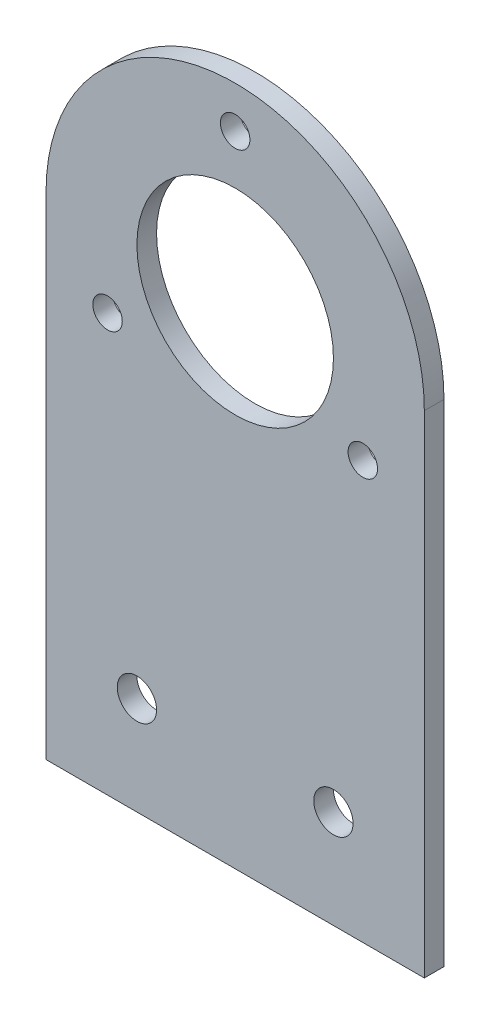
ISO-10303-21;
HEADER;
FILE_DESCRIPTION(('STEP AP214'),'2;1');
FILE_NAME('part.step','',(''),(''),'','','');
FILE_SCHEMA(('AUTOMOTIVE_DESIGN { 1 0 10303 214 1 1 1 1 }'));
ENDSEC;
DATA;
#1=APPLICATION_CONTEXT('core data for automotive mechanical design processes');
#2=APPLICATION_PROTOCOL_DEFINITION('international standard','automotive_design',2000,#1);
#3=PRODUCT_CONTEXT('',#1,'mechanical');
#4=PRODUCT('Part','Part','',(#3));
#5=PRODUCT_RELATED_PRODUCT_CATEGORY('part','',(#4));
#6=PRODUCT_DEFINITION_FORMATION('','',#4);
#7=PRODUCT_DEFINITION_CONTEXT('part definition',#1,'design');
#8=PRODUCT_DEFINITION('design','',#6,#7);
#9=PRODUCT_DEFINITION_SHAPE('','',#8);
#10=(LENGTH_UNIT() NAMED_UNIT(*) SI_UNIT(.MILLI.,.METRE.));
#11=(NAMED_UNIT(*) PLANE_ANGLE_UNIT() SI_UNIT($,.RADIAN.));
#12=(NAMED_UNIT(*) SI_UNIT($,.STERADIAN.) SOLID_ANGLE_UNIT());
#13=UNCERTAINTY_MEASURE_WITH_UNIT(LENGTH_MEASURE(1.E-05),#10,'distance_accuracy_value','');
#14=(GEOMETRIC_REPRESENTATION_CONTEXT(3) GLOBAL_UNCERTAINTY_ASSIGNED_CONTEXT((#13)) GLOBAL_UNIT_ASSIGNED_CONTEXT((#10,
#11,#12)) REPRESENTATION_CONTEXT('',''));
#15=CARTESIAN_POINT('',(0.,0.,0.));
#16=DIRECTION('',(0.,0.,1.));
#17=DIRECTION('',(1.,0.,0.));
#18=AXIS2_PLACEMENT_3D('',#15,#16,#17);
#19=CARTESIAN_POINT('',(0.,25.,2.));
#20=DIRECTION('',(0.,0.,-1.));
#21=DIRECTION('',(-1.,0.,0.));
#22=AXIS2_PLACEMENT_3D('',#19,#20,#21);
#23=CYLINDRICAL_SURFACE('',#22,19.25);
#24=CARTESIAN_POINT('',(0.,25.,0.));
#25=DIRECTION('',(0.,0.,1.));
#26=DIRECTION('',(1.,0.,0.));
#27=AXIS2_PLACEMENT_3D('',#24,#25,#26);
#28=CIRCLE('',#27,19.25);
#29=CARTESIAN_POINT('',(-19.25,25.,0.));
#30=VERTEX_POINT('',#29);
#31=CARTESIAN_POINT('',(19.25,25.,0.));
#32=VERTEX_POINT('',#31);
#33=EDGE_CURVE('E106',#30,#32,#28,.F.);
#34=ORIENTED_EDGE('',*,*,#33,.F.);
#35=DIRECTION('',(0.,0.,-1.));
#36=VECTOR('',#35,1.);
#37=CARTESIAN_POINT('',(-19.25,25.,2.));
#38=LINE('',#37,#36);
#39=CARTESIAN_POINT('',(-19.25,25.,2.));
#40=VERTEX_POINT('',#39);
#41=EDGE_CURVE('E11',#40,#30,#38,.T.);
#42=ORIENTED_EDGE('',*,*,#41,.F.);
#43=CARTESIAN_POINT('',(0.,25.,2.));
#44=DIRECTION('',(0.,0.,1.));
#45=DIRECTION('',(1.,0.,0.));
#46=AXIS2_PLACEMENT_3D('',#43,#44,#45);
#47=CIRCLE('',#46,19.25);
#48=CARTESIAN_POINT('',(19.25,25.,2.));
#49=VERTEX_POINT('',#48);
#50=EDGE_CURVE('E90',#40,#49,#47,.F.);
#51=ORIENTED_EDGE('',*,*,#50,.T.);
#52=DIRECTION('',(0.,0.,-1.));
#53=VECTOR('',#52,1.);
#54=CARTESIAN_POINT('',(19.25,25.,2.));
#55=LINE('',#54,#53);
#56=EDGE_CURVE('E52',#49,#32,#55,.T.);
#57=ORIENTED_EDGE('',*,*,#56,.T.);
#58=EDGE_LOOP('',(#34,#42,#51,#57));
#59=FACE_BOUND('',#58,.T.);
#60=ADVANCED_FACE('F35',(#59),#23,.T.);
#61=CARTESIAN_POINT('',(-19.25,0.,2.));
#62=DIRECTION('',(1.,0.,0.));
#63=DIRECTION('',(0.,1.,0.));
#64=AXIS2_PLACEMENT_3D('',#61,#62,#63);
#65=PLANE('',#64);
#66=DIRECTION('',(0.,-1.,0.));
#67=VECTOR('',#66,1.);
#68=CARTESIAN_POINT('',(-19.25,0.,0.));
#69=LINE('',#68,#67);
#70=CARTESIAN_POINT('',(-19.25,-25.,0.));
#71=VERTEX_POINT('',#70);
#72=EDGE_CURVE('E95',#30,#71,#69,.T.);
#73=ORIENTED_EDGE('',*,*,#72,.T.);
#74=DIRECTION('',(0.,0.,-1.));
#75=VECTOR('',#74,1.);
#76=CARTESIAN_POINT('',(-19.25,-25.,2.));
#77=LINE('',#76,#75);
#78=CARTESIAN_POINT('',(-19.25,-25.,2.));
#79=VERTEX_POINT('',#78);
#80=EDGE_CURVE('E44',#79,#71,#77,.T.);
#81=ORIENTED_EDGE('',*,*,#80,.F.);
#82=DIRECTION('',(0.,-1.,0.));
#83=VECTOR('',#82,1.);
#84=CARTESIAN_POINT('',(-19.25,0.,2.));
#85=LINE('',#84,#83);
#86=EDGE_CURVE('E86',#40,#79,#85,.T.);
#87=ORIENTED_EDGE('',*,*,#86,.F.);
#88=ORIENTED_EDGE('',*,*,#41,.T.);
#89=EDGE_LOOP('',(#73,#81,#87,#88));
#90=FACE_BOUND('',#89,.T.);
#91=ADVANCED_FACE('F93',(#90),#65,.F.);
#92=CARTESIAN_POINT('',(0.,-25.,2.));
#93=DIRECTION('',(0.,1.,0.));
#94=DIRECTION('',(0.,0.,1.));
#95=AXIS2_PLACEMENT_3D('',#92,#93,#94);
#96=PLANE('',#95);
#97=DIRECTION('',(1.,0.,0.));
#98=VECTOR('',#97,1.);
#99=CARTESIAN_POINT('',(0.,-25.,0.));
#100=LINE('',#99,#98);
#101=CARTESIAN_POINT('',(19.25,-25.,0.));
#102=VERTEX_POINT('',#101);
#103=EDGE_CURVE('E103',#71,#102,#100,.T.);
#104=ORIENTED_EDGE('',*,*,#103,.T.);
#105=DIRECTION('',(0.,0.,-1.));
#106=VECTOR('',#105,1.);
#107=CARTESIAN_POINT('',(19.25,-25.,2.));
#108=LINE('',#107,#106);
#109=CARTESIAN_POINT('',(19.25,-25.,2.));
#110=VERTEX_POINT('',#109);
#111=EDGE_CURVE('E66',#110,#102,#108,.T.);
#112=ORIENTED_EDGE('',*,*,#111,.F.);
#113=DIRECTION('',(1.,0.,0.));
#114=VECTOR('',#113,1.);
#115=CARTESIAN_POINT('',(0.,-25.,2.));
#116=LINE('',#115,#114);
#117=EDGE_CURVE('E78',#79,#110,#116,.T.);
#118=ORIENTED_EDGE('',*,*,#117,.F.);
#119=ORIENTED_EDGE('',*,*,#80,.T.);
#120=EDGE_LOOP('',(#104,#112,#118,#119));
#121=FACE_BOUND('',#120,.T.);
#122=ADVANCED_FACE('F80',(#121),#96,.F.);
#123=CARTESIAN_POINT('',(0.,25.,2.));
#124=DIRECTION('',(0.,0.,-1.));
#125=DIRECTION('',(-1.,0.,0.));
#126=AXIS2_PLACEMENT_3D('',#123,#124,#125);
#127=CYLINDRICAL_SURFACE('',#126,10.);
#128=CARTESIAN_POINT('',(0.,25.,2.));
#129=DIRECTION('',(0.,0.,1.));
#130=DIRECTION('',(1.,0.,0.));
#131=AXIS2_PLACEMENT_3D('',#128,#129,#130);
#132=CIRCLE('',#131,10.);
#133=CARTESIAN_POINT('',(10.,25.,2.));
#134=VERTEX_POINT('',#133);
#135=EDGE_CURVE('E128',#134,#134,#132,.T.);
#136=ORIENTED_EDGE('',*,*,#135,.T.);
#137=EDGE_LOOP('',(#136));
#138=FACE_BOUND('',#137,.T.);
#139=CARTESIAN_POINT('',(0.,25.,0.));
#140=DIRECTION('',(0.,0.,1.));
#141=DIRECTION('',(1.,0.,0.));
#142=AXIS2_PLACEMENT_3D('',#139,#140,#141);
#143=CIRCLE('',#142,10.);
#144=CARTESIAN_POINT('',(10.,25.,0.));
#145=VERTEX_POINT('',#144);
#146=EDGE_CURVE('E108',#145,#145,#143,.T.);
#147=ORIENTED_EDGE('',*,*,#146,.F.);
#148=EDGE_LOOP('',(#147));
#149=FACE_BOUND('',#148,.T.);
#150=ADVANCED_FACE('F163',(#138,#149),#127,.F.);
#151=CARTESIAN_POINT('',(0.,40.,2.));
#152=DIRECTION('',(0.,0.,-1.));
#153=DIRECTION('',(-1.,0.,0.));
#154=AXIS2_PLACEMENT_3D('',#151,#152,#153);
#155=CYLINDRICAL_SURFACE('',#154,1.5);
#156=CARTESIAN_POINT('',(0.,40.,2.));
#157=DIRECTION('',(0.,0.,1.));
#158=DIRECTION('',(1.,0.,0.));
#159=AXIS2_PLACEMENT_3D('',#156,#157,#158);
#160=CIRCLE('',#159,1.5);
#161=CARTESIAN_POINT('',(1.5,40.,2.));
#162=VERTEX_POINT('',#161);
#163=EDGE_CURVE('E131',#162,#162,#160,.T.);
#164=ORIENTED_EDGE('',*,*,#163,.T.);
#165=EDGE_LOOP('',(#164));
#166=FACE_BOUND('',#165,.T.);
#167=CARTESIAN_POINT('',(0.,40.,0.));
#168=DIRECTION('',(0.,0.,1.));
#169=DIRECTION('',(1.,0.,0.));
#170=AXIS2_PLACEMENT_3D('',#167,#168,#169);
#171=CIRCLE('',#170,1.5);
#172=CARTESIAN_POINT('',(1.5,40.,0.));
#173=VERTEX_POINT('',#172);
#174=EDGE_CURVE('E111',#173,#173,#171,.T.);
#175=ORIENTED_EDGE('',*,*,#174,.F.);
#176=EDGE_LOOP('',(#175));
#177=FACE_BOUND('',#176,.T.);
#178=ADVANCED_FACE('F166',(#166,#177),#155,.F.);
#179=CARTESIAN_POINT('',(-9.99999999999999,-15.,2.));
#180=DIRECTION('',(0.,0.,-1.));
#181=DIRECTION('',(-1.,0.,0.));
#182=AXIS2_PLACEMENT_3D('',#179,#180,#181);
#183=CYLINDRICAL_SURFACE('',#182,2.);
#184=CARTESIAN_POINT('',(-9.99999999999999,-15.,2.));
#185=DIRECTION('',(0.,0.,1.));
#186=DIRECTION('',(1.,0.,0.));
#187=AXIS2_PLACEMENT_3D('',#184,#185,#186);
#188=CIRCLE('',#187,2.);
#189=CARTESIAN_POINT('',(-7.99999999999999,-15.,2.));
#190=VERTEX_POINT('',#189);
#191=EDGE_CURVE('E134',#190,#190,#188,.T.);
#192=ORIENTED_EDGE('',*,*,#191,.T.);
#193=EDGE_LOOP('',(#192));
#194=FACE_BOUND('',#193,.T.);
#195=CARTESIAN_POINT('',(-9.99999999999999,-15.,0.));
#196=DIRECTION('',(0.,0.,1.));
#197=DIRECTION('',(1.,0.,0.));
#198=AXIS2_PLACEMENT_3D('',#195,#196,#197);
#199=CIRCLE('',#198,2.);
#200=CARTESIAN_POINT('',(-7.99999999999999,-15.,0.));
#201=VERTEX_POINT('',#200);
#202=EDGE_CURVE('E114',#201,#201,#199,.T.);
#203=ORIENTED_EDGE('',*,*,#202,.F.);
#204=EDGE_LOOP('',(#203));
#205=FACE_BOUND('',#204,.T.);
#206=ADVANCED_FACE('F190',(#194,#205),#183,.F.);
#207=CARTESIAN_POINT('',(10.,-15.,2.));
#208=DIRECTION('',(0.,0.,-1.));
#209=DIRECTION('',(-1.,0.,0.));
#210=AXIS2_PLACEMENT_3D('',#207,#208,#209);
#211=CYLINDRICAL_SURFACE('',#210,2.);
#212=CARTESIAN_POINT('',(10.,-15.,2.));
#213=DIRECTION('',(0.,0.,1.));
#214=DIRECTION('',(1.,0.,0.));
#215=AXIS2_PLACEMENT_3D('',#212,#213,#214);
#216=CIRCLE('',#215,2.);
#217=CARTESIAN_POINT('',(12.,-15.,2.));
#218=VERTEX_POINT('',#217);
#219=EDGE_CURVE('E137',#218,#218,#216,.T.);
#220=ORIENTED_EDGE('',*,*,#219,.T.);
#221=EDGE_LOOP('',(#220));
#222=FACE_BOUND('',#221,.T.);
#223=CARTESIAN_POINT('',(10.,-15.,0.));
#224=DIRECTION('',(0.,0.,1.));
#225=DIRECTION('',(1.,0.,0.));
#226=AXIS2_PLACEMENT_3D('',#223,#224,#225);
#227=CIRCLE('',#226,2.);
#228=CARTESIAN_POINT('',(12.,-15.,0.));
#229=VERTEX_POINT('',#228);
#230=EDGE_CURVE('E117',#229,#229,#227,.T.);
#231=ORIENTED_EDGE('',*,*,#230,.F.);
#232=EDGE_LOOP('',(#231));
#233=FACE_BOUND('',#232,.T.);
#234=ADVANCED_FACE('F194',(#222,#233),#211,.F.);
#235=CARTESIAN_POINT('',(12.9903810567669,17.5000000000001,2.));
#236=DIRECTION('',(0.,0.,-1.));
#237=DIRECTION('',(-1.,0.,0.));
#238=AXIS2_PLACEMENT_3D('',#235,#236,#237);
#239=CYLINDRICAL_SURFACE('',#238,1.5);
#240=CARTESIAN_POINT('',(12.9903810567669,17.5000000000001,2.));
#241=DIRECTION('',(0.,0.,1.));
#242=DIRECTION('',(1.,0.,0.));
#243=AXIS2_PLACEMENT_3D('',#240,#241,#242);
#244=CIRCLE('',#243,1.5);
#245=CARTESIAN_POINT('',(14.4903810567669,17.5000000000001,2.));
#246=VERTEX_POINT('',#245);
#247=EDGE_CURVE('E140',#246,#246,#244,.T.);
#248=ORIENTED_EDGE('',*,*,#247,.T.);
#249=EDGE_LOOP('',(#248));
#250=FACE_BOUND('',#249,.T.);
#251=CARTESIAN_POINT('',(12.9903810567669,17.5000000000001,0.));
#252=DIRECTION('',(0.,0.,1.));
#253=DIRECTION('',(1.,0.,0.));
#254=AXIS2_PLACEMENT_3D('',#251,#252,#253);
#255=CIRCLE('',#254,1.5);
#256=CARTESIAN_POINT('',(14.4903810567669,17.5000000000001,0.));
#257=VERTEX_POINT('',#256);
#258=EDGE_CURVE('E120',#257,#257,#255,.T.);
#259=ORIENTED_EDGE('',*,*,#258,.F.);
#260=EDGE_LOOP('',(#259));
#261=FACE_BOUND('',#260,.T.);
#262=ADVANCED_FACE('F179',(#250,#261),#239,.F.);
#263=CARTESIAN_POINT('',(-12.9903810567663,17.4999999999999,2.));
#264=DIRECTION('',(0.,0.,-1.));
#265=DIRECTION('',(-1.,0.,0.));
#266=AXIS2_PLACEMENT_3D('',#263,#264,#265);
#267=CYLINDRICAL_SURFACE('',#266,1.5);
#268=CARTESIAN_POINT('',(-12.9903810567663,17.4999999999999,2.));
#269=DIRECTION('',(0.,0.,1.));
#270=DIRECTION('',(1.,0.,0.));
#271=AXIS2_PLACEMENT_3D('',#268,#269,#270);
#272=CIRCLE('',#271,1.5);
#273=CARTESIAN_POINT('',(-11.4903810567663,17.4999999999999,2.));
#274=VERTEX_POINT('',#273);
#275=EDGE_CURVE('E102',#274,#274,#272,.T.);
#276=ORIENTED_EDGE('',*,*,#275,.T.);
#277=EDGE_LOOP('',(#276));
#278=FACE_BOUND('',#277,.T.);
#279=CARTESIAN_POINT('',(-12.9903810567663,17.4999999999999,0.));
#280=DIRECTION('',(0.,0.,1.));
#281=DIRECTION('',(1.,0.,0.));
#282=AXIS2_PLACEMENT_3D('',#279,#280,#281);
#283=CIRCLE('',#282,1.5);
#284=CARTESIAN_POINT('',(-11.4903810567663,17.4999999999999,0.));
#285=VERTEX_POINT('',#284);
#286=EDGE_CURVE('E123',#285,#285,#283,.T.);
#287=ORIENTED_EDGE('',*,*,#286,.F.);
#288=EDGE_LOOP('',(#287));
#289=FACE_BOUND('',#288,.T.);
#290=ADVANCED_FACE('F37',(#278,#289),#267,.F.);
#291=CARTESIAN_POINT('',(19.25,0.,2.));
#292=DIRECTION('',(1.,0.,0.));
#293=DIRECTION('',(0.,1.,0.));
#294=AXIS2_PLACEMENT_3D('',#291,#292,#293);
#295=PLANE('',#294);
#296=DIRECTION('',(0.,-1.,0.));
#297=VECTOR('',#296,1.);
#298=CARTESIAN_POINT('',(19.25,0.,0.));
#299=LINE('',#298,#297);
#300=EDGE_CURVE('E99',#32,#102,#299,.T.);
#301=ORIENTED_EDGE('',*,*,#300,.F.);
#302=ORIENTED_EDGE('',*,*,#56,.F.);
#303=DIRECTION('',(0.,-1.,0.));
#304=VECTOR('',#303,1.);
#305=CARTESIAN_POINT('',(19.25,0.,2.));
#306=LINE('',#305,#304);
#307=EDGE_CURVE('E85',#49,#110,#306,.T.);
#308=ORIENTED_EDGE('',*,*,#307,.T.);
#309=ORIENTED_EDGE('',*,*,#111,.T.);
#310=EDGE_LOOP('',(#301,#302,#308,#309));
#311=FACE_BOUND('',#310,.T.);
#312=ADVANCED_FACE('F151',(#311),#295,.T.);
#313=CARTESIAN_POINT('',(0.,0.,2.));
#314=DIRECTION('',(0.,0.,1.));
#315=DIRECTION('',(1.,0.,0.));
#316=AXIS2_PLACEMENT_3D('',#313,#314,#315);
#317=PLANE('',#316);
#318=ORIENTED_EDGE('',*,*,#275,.F.);
#319=EDGE_LOOP('',(#318));
#320=FACE_BOUND('',#319,.T.);
#321=ORIENTED_EDGE('',*,*,#247,.F.);
#322=EDGE_LOOP('',(#321));
#323=FACE_BOUND('',#322,.T.);
#324=ORIENTED_EDGE('',*,*,#219,.F.);
#325=EDGE_LOOP('',(#324));
#326=FACE_BOUND('',#325,.T.);
#327=ORIENTED_EDGE('',*,*,#191,.F.);
#328=EDGE_LOOP('',(#327));
#329=FACE_BOUND('',#328,.T.);
#330=ORIENTED_EDGE('',*,*,#163,.F.);
#331=EDGE_LOOP('',(#330));
#332=FACE_BOUND('',#331,.T.);
#333=ORIENTED_EDGE('',*,*,#135,.F.);
#334=EDGE_LOOP('',(#333));
#335=FACE_BOUND('',#334,.T.);
#336=ORIENTED_EDGE('',*,*,#50,.F.);
#337=ORIENTED_EDGE('',*,*,#86,.T.);
#338=ORIENTED_EDGE('',*,*,#117,.T.);
#339=ORIENTED_EDGE('',*,*,#307,.F.);
#340=EDGE_LOOP('',(#336,#337,#338,#339));
#341=FACE_BOUND('',#340,.T.);
#342=ADVANCED_FACE('F89',(#320,#323,#326,#329,#332,#335,#341),#317,.T.);
#343=CARTESIAN_POINT('',(0.,0.,0.));
#344=DIRECTION('',(0.,0.,1.));
#345=DIRECTION('',(1.,0.,0.));
#346=AXIS2_PLACEMENT_3D('',#343,#344,#345);
#347=PLANE('',#346);
#348=ORIENTED_EDGE('',*,*,#286,.T.);
#349=EDGE_LOOP('',(#348));
#350=FACE_BOUND('',#349,.T.);
#351=ORIENTED_EDGE('',*,*,#258,.T.);
#352=EDGE_LOOP('',(#351));
#353=FACE_BOUND('',#352,.T.);
#354=ORIENTED_EDGE('',*,*,#230,.T.);
#355=EDGE_LOOP('',(#354));
#356=FACE_BOUND('',#355,.T.);
#357=ORIENTED_EDGE('',*,*,#202,.T.);
#358=EDGE_LOOP('',(#357));
#359=FACE_BOUND('',#358,.T.);
#360=ORIENTED_EDGE('',*,*,#174,.T.);
#361=EDGE_LOOP('',(#360));
#362=FACE_BOUND('',#361,.T.);
#363=ORIENTED_EDGE('',*,*,#146,.T.);
#364=EDGE_LOOP('',(#363));
#365=FACE_BOUND('',#364,.T.);
#366=ORIENTED_EDGE('',*,*,#33,.T.);
#367=ORIENTED_EDGE('',*,*,#300,.T.);
#368=ORIENTED_EDGE('',*,*,#103,.F.);
#369=ORIENTED_EDGE('',*,*,#72,.F.);
#370=EDGE_LOOP('',(#366,#367,#368,#369));
#371=FACE_BOUND('',#370,.T.);
#372=ADVANCED_FACE('F150',(#350,#353,#356,#359,#362,#365,#371),#347,.F.);
#373=CLOSED_SHELL('',(#60,#91,#122,#150,#178,#206,#234,#262,#290,#312,#342,#372));
#374=MANIFOLD_SOLID_BREP('B2',#373);
#375=ADVANCED_BREP_SHAPE_REPRESENTATION('',(#18,#374),#14);
#376=SHAPE_DEFINITION_REPRESENTATION(#9,#375);
ENDSEC;
END-ISO-10303-21;
